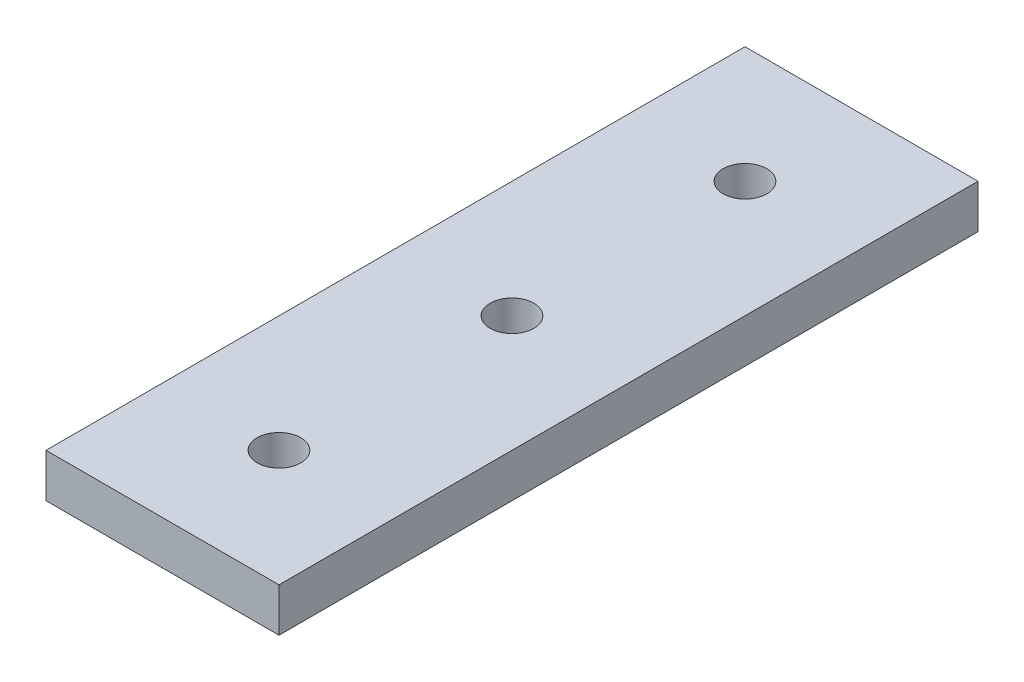
ISO-10303-21;
HEADER;
FILE_DESCRIPTION(('STEP AP214'),'2;1');
FILE_NAME('part.step','',(''),(''),'','','');
FILE_SCHEMA(('AUTOMOTIVE_DESIGN { 1 0 10303 214 1 1 1 1 }'));
ENDSEC;
DATA;
#1=APPLICATION_CONTEXT('core data for automotive mechanical design processes');
#2=APPLICATION_PROTOCOL_DEFINITION('international standard','automotive_design',2000,#1);
#3=PRODUCT_CONTEXT('',#1,'mechanical');
#4=PRODUCT('Part','Part','',(#3));
#5=PRODUCT_RELATED_PRODUCT_CATEGORY('part','',(#4));
#6=PRODUCT_DEFINITION_FORMATION('','',#4);
#7=PRODUCT_DEFINITION_CONTEXT('part definition',#1,'design');
#8=PRODUCT_DEFINITION('design','',#6,#7);
#9=PRODUCT_DEFINITION_SHAPE('','',#8);
#10=(LENGTH_UNIT() NAMED_UNIT(*) SI_UNIT(.MILLI.,.METRE.));
#11=(NAMED_UNIT(*) PLANE_ANGLE_UNIT() SI_UNIT($,.RADIAN.));
#12=(NAMED_UNIT(*) SI_UNIT($,.STERADIAN.) SOLID_ANGLE_UNIT());
#13=UNCERTAINTY_MEASURE_WITH_UNIT(LENGTH_MEASURE(1.E-05),#10,'distance_accuracy_value','');
#14=(GEOMETRIC_REPRESENTATION_CONTEXT(3) GLOBAL_UNCERTAINTY_ASSIGNED_CONTEXT((#13)) GLOBAL_UNIT_ASSIGNED_CONTEXT((#10,
#11,#12)) REPRESENTATION_CONTEXT('',''));
#15=CARTESIAN_POINT('',(0.,0.,0.));
#16=DIRECTION('',(0.,0.,1.));
#17=DIRECTION('',(1.,0.,0.));
#18=AXIS2_PLACEMENT_3D('',#15,#16,#17);
#19=CARTESIAN_POINT('',(12.7,4.7625,-38.1));
#20=DIRECTION('',(-1.,0.,0.));
#21=DIRECTION('',(0.,0.,1.));
#22=AXIS2_PLACEMENT_3D('',#19,#20,#21);
#23=PLANE('',#22);
#24=DIRECTION('',(0.,0.,-1.));
#25=VECTOR('',#24,1.);
#26=CARTESIAN_POINT('',(12.7,0.,-38.1));
#27=LINE('',#26,#25);
#28=CARTESIAN_POINT('',(12.7,0.,38.1));
#29=VERTEX_POINT('',#28);
#30=CARTESIAN_POINT('',(12.7,0.,-38.1));
#31=VERTEX_POINT('',#30);
#32=EDGE_CURVE('E97',#29,#31,#27,.T.);
#33=ORIENTED_EDGE('',*,*,#32,.T.);
#34=DIRECTION('',(0.,-1.,0.));
#35=VECTOR('',#34,1.);
#36=CARTESIAN_POINT('',(12.7,4.7625,-38.1));
#37=LINE('',#36,#35);
#38=CARTESIAN_POINT('',(12.7,4.7625,-38.1));
#39=VERTEX_POINT('',#38);
#40=EDGE_CURVE('E11',#39,#31,#37,.T.);
#41=ORIENTED_EDGE('',*,*,#40,.F.);
#42=DIRECTION('',(0.,0.,-1.));
#43=VECTOR('',#42,1.);
#44=CARTESIAN_POINT('',(12.7,4.7625,-38.1));
#45=LINE('',#44,#43);
#46=CARTESIAN_POINT('',(12.7,4.7625,38.1));
#47=VERTEX_POINT('',#46);
#48=EDGE_CURVE('E85',#47,#39,#45,.T.);
#49=ORIENTED_EDGE('',*,*,#48,.F.);
#50=DIRECTION('',(0.,-1.,0.));
#51=VECTOR('',#50,1.);
#52=CARTESIAN_POINT('',(12.7,4.7625,38.1));
#53=LINE('',#52,#51);
#54=EDGE_CURVE('E93',#47,#29,#53,.T.);
#55=ORIENTED_EDGE('',*,*,#54,.T.);
#56=EDGE_LOOP('',(#33,#41,#49,#55));
#57=FACE_BOUND('',#56,.T.);
#58=ADVANCED_FACE('F34',(#57),#23,.F.);
#59=CARTESIAN_POINT('',(-12.7,4.7625,-38.1));
#60=DIRECTION('',(0.,0.,1.));
#61=DIRECTION('',(1.,0.,0.));
#62=AXIS2_PLACEMENT_3D('',#59,#60,#61);
#63=PLANE('',#62);
#64=DIRECTION('',(-1.,0.,0.));
#65=VECTOR('',#64,1.);
#66=CARTESIAN_POINT('',(-12.7,0.,-38.1));
#67=LINE('',#66,#65);
#68=CARTESIAN_POINT('',(-12.7,0.,-38.1));
#69=VERTEX_POINT('',#68);
#70=EDGE_CURVE('E89',#31,#69,#67,.T.);
#71=ORIENTED_EDGE('',*,*,#70,.T.);
#72=DIRECTION('',(0.,-1.,0.));
#73=VECTOR('',#72,1.);
#74=CARTESIAN_POINT('',(-12.7,4.7625,-38.1));
#75=LINE('',#74,#73);
#76=CARTESIAN_POINT('',(-12.7,4.7625,-38.1));
#77=VERTEX_POINT('',#76);
#78=EDGE_CURVE('E42',#77,#69,#75,.T.);
#79=ORIENTED_EDGE('',*,*,#78,.F.);
#80=DIRECTION('',(-1.,0.,0.));
#81=VECTOR('',#80,1.);
#82=CARTESIAN_POINT('',(-12.7,4.7625,-38.1));
#83=LINE('',#82,#81);
#84=EDGE_CURVE('E80',#39,#77,#83,.T.);
#85=ORIENTED_EDGE('',*,*,#84,.F.);
#86=ORIENTED_EDGE('',*,*,#40,.T.);
#87=EDGE_LOOP('',(#71,#79,#85,#86));
#88=FACE_BOUND('',#87,.T.);
#89=ADVANCED_FACE('F88',(#88),#63,.F.);
#90=CARTESIAN_POINT('',(-12.7,4.7625,-38.1));
#91=DIRECTION('',(1.,0.,0.));
#92=DIRECTION('',(0.,0.,-1.));
#93=AXIS2_PLACEMENT_3D('',#90,#91,#92);
#94=PLANE('',#93);
#95=DIRECTION('',(0.,0.,1.));
#96=VECTOR('',#95,1.);
#97=CARTESIAN_POINT('',(-12.7,0.,-38.1));
#98=LINE('',#97,#96);
#99=CARTESIAN_POINT('',(-12.7,0.,38.1));
#100=VERTEX_POINT('',#99);
#101=EDGE_CURVE('E67',#69,#100,#98,.T.);
#102=ORIENTED_EDGE('',*,*,#101,.T.);
#103=DIRECTION('',(0.,-1.,0.));
#104=VECTOR('',#103,1.);
#105=CARTESIAN_POINT('',(-12.7,4.7625,38.1));
#106=LINE('',#105,#104);
#107=CARTESIAN_POINT('',(-12.7,4.7625,38.1));
#108=VERTEX_POINT('',#107);
#109=EDGE_CURVE('E90',#108,#100,#106,.T.);
#110=ORIENTED_EDGE('',*,*,#109,.F.);
#111=DIRECTION('',(0.,0.,1.));
#112=VECTOR('',#111,1.);
#113=CARTESIAN_POINT('',(-12.7,4.7625,-38.1));
#114=LINE('',#113,#112);
#115=EDGE_CURVE('E83',#77,#108,#114,.T.);
#116=ORIENTED_EDGE('',*,*,#115,.F.);
#117=ORIENTED_EDGE('',*,*,#78,.T.);
#118=EDGE_LOOP('',(#102,#110,#116,#117));
#119=FACE_BOUND('',#118,.T.);
#120=ADVANCED_FACE('F91',(#119),#94,.F.);
#121=CARTESIAN_POINT('',(-12.7,4.7625,38.1));
#122=DIRECTION('',(0.,0.,-1.));
#123=DIRECTION('',(-1.,0.,0.));
#124=AXIS2_PLACEMENT_3D('',#121,#122,#123);
#125=PLANE('',#124);
#126=DIRECTION('',(1.,0.,0.));
#127=VECTOR('',#126,1.);
#128=CARTESIAN_POINT('',(-12.7,0.,38.1));
#129=LINE('',#128,#127);
#130=EDGE_CURVE('E73',#100,#29,#129,.T.);
#131=ORIENTED_EDGE('',*,*,#130,.T.);
#132=ORIENTED_EDGE('',*,*,#54,.F.);
#133=DIRECTION('',(1.,0.,0.));
#134=VECTOR('',#133,1.);
#135=CARTESIAN_POINT('',(-12.7,4.7625,38.1));
#136=LINE('',#135,#134);
#137=EDGE_CURVE('E50',#108,#47,#136,.T.);
#138=ORIENTED_EDGE('',*,*,#137,.F.);
#139=ORIENTED_EDGE('',*,*,#109,.T.);
#140=EDGE_LOOP('',(#131,#132,#138,#139));
#141=FACE_BOUND('',#140,.T.);
#142=ADVANCED_FACE('F105',(#141),#125,.F.);
#143=CARTESIAN_POINT('',(0.,4.7625,0.));
#144=DIRECTION('',(0.,1.,0.));
#145=DIRECTION('',(0.,0.,1.));
#146=AXIS2_PLACEMENT_3D('',#143,#144,#145);
#147=PLANE('',#146);
#148=CARTESIAN_POINT('',(0.,4.7625,-25.4));
#149=DIRECTION('',(0.,1.,0.));
#150=DIRECTION('',(0.,0.,1.));
#151=AXIS2_PLACEMENT_3D('',#148,#149,#150);
#152=CIRCLE('',#151,2.38125);
#153=CARTESIAN_POINT('',(0.,4.7625,-23.01875));
#154=VERTEX_POINT('',#153);
#155=EDGE_CURVE('E123',#154,#154,#152,.T.);
#156=ORIENTED_EDGE('',*,*,#155,.F.);
#157=EDGE_LOOP('',(#156));
#158=FACE_BOUND('',#157,.T.);
#159=CARTESIAN_POINT('',(0.,4.7625,0.));
#160=DIRECTION('',(0.,1.,0.));
#161=DIRECTION('',(0.,0.,1.));
#162=AXIS2_PLACEMENT_3D('',#159,#160,#161);
#163=CIRCLE('',#162,2.38125);
#164=CARTESIAN_POINT('',(0.,4.7625,2.38125));
#165=VERTEX_POINT('',#164);
#166=EDGE_CURVE('E117',#165,#165,#163,.T.);
#167=ORIENTED_EDGE('',*,*,#166,.F.);
#168=EDGE_LOOP('',(#167));
#169=FACE_BOUND('',#168,.T.);
#170=CARTESIAN_POINT('',(0.,4.7625,25.4));
#171=DIRECTION('',(0.,1.,0.));
#172=DIRECTION('',(0.,0.,1.));
#173=AXIS2_PLACEMENT_3D('',#170,#171,#172);
#174=CIRCLE('',#173,2.38125);
#175=CARTESIAN_POINT('',(0.,4.7625,27.78125));
#176=VERTEX_POINT('',#175);
#177=EDGE_CURVE('E111',#176,#176,#174,.T.);
#178=ORIENTED_EDGE('',*,*,#177,.F.);
#179=EDGE_LOOP('',(#178));
#180=FACE_BOUND('',#179,.T.);
#181=ORIENTED_EDGE('',*,*,#48,.T.);
#182=ORIENTED_EDGE('',*,*,#84,.T.);
#183=ORIENTED_EDGE('',*,*,#115,.T.);
#184=ORIENTED_EDGE('',*,*,#137,.T.);
#185=EDGE_LOOP('',(#181,#182,#183,#184));
#186=FACE_BOUND('',#185,.T.);
#187=ADVANCED_FACE('F81',(#158,#169,#180,#186),#147,.T.);
#188=CARTESIAN_POINT('',(0.,0.,0.));
#189=DIRECTION('',(0.,1.,0.));
#190=DIRECTION('',(0.,0.,1.));
#191=AXIS2_PLACEMENT_3D('',#188,#189,#190);
#192=PLANE('',#191);
#193=CARTESIAN_POINT('',(0.,0.,-25.4));
#194=DIRECTION('',(0.,1.,0.));
#195=DIRECTION('',(0.,0.,1.));
#196=AXIS2_PLACEMENT_3D('',#193,#194,#195);
#197=CIRCLE('',#196,2.38125);
#198=CARTESIAN_POINT('',(0.,0.,-23.01875));
#199=VERTEX_POINT('',#198);
#200=EDGE_CURVE('E100',#199,#199,#197,.T.);
#201=ORIENTED_EDGE('',*,*,#200,.T.);
#202=EDGE_LOOP('',(#201));
#203=FACE_BOUND('',#202,.T.);
#204=CARTESIAN_POINT('',(0.,0.,0.));
#205=DIRECTION('',(0.,1.,0.));
#206=DIRECTION('',(0.,0.,1.));
#207=AXIS2_PLACEMENT_3D('',#204,#205,#206);
#208=CIRCLE('',#207,2.38125);
#209=CARTESIAN_POINT('',(0.,0.,2.38125));
#210=VERTEX_POINT('',#209);
#211=EDGE_CURVE('E120',#210,#210,#208,.T.);
#212=ORIENTED_EDGE('',*,*,#211,.T.);
#213=EDGE_LOOP('',(#212));
#214=FACE_BOUND('',#213,.T.);
#215=CARTESIAN_POINT('',(0.,0.,25.4));
#216=DIRECTION('',(0.,1.,0.));
#217=DIRECTION('',(0.,0.,1.));
#218=AXIS2_PLACEMENT_3D('',#215,#216,#217);
#219=CIRCLE('',#218,2.38125);
#220=CARTESIAN_POINT('',(0.,0.,27.78125));
#221=VERTEX_POINT('',#220);
#222=EDGE_CURVE('E114',#221,#221,#219,.T.);
#223=ORIENTED_EDGE('',*,*,#222,.T.);
#224=EDGE_LOOP('',(#223));
#225=FACE_BOUND('',#224,.T.);
#226=ORIENTED_EDGE('',*,*,#32,.F.);
#227=ORIENTED_EDGE('',*,*,#130,.F.);
#228=ORIENTED_EDGE('',*,*,#101,.F.);
#229=ORIENTED_EDGE('',*,*,#70,.F.);
#230=EDGE_LOOP('',(#226,#227,#228,#229));
#231=FACE_BOUND('',#230,.T.);
#232=ADVANCED_FACE('F108',(#203,#214,#225,#231),#192,.F.);
#233=CARTESIAN_POINT('',(0.,0.,25.4));
#234=DIRECTION('',(0.,1.,0.));
#235=DIRECTION('',(0.,0.,1.));
#236=AXIS2_PLACEMENT_3D('',#233,#234,#235);
#237=CYLINDRICAL_SURFACE('',#236,2.38125);
#238=ORIENTED_EDGE('',*,*,#222,.F.);
#239=EDGE_LOOP('',(#238));
#240=FACE_BOUND('',#239,.T.);
#241=ORIENTED_EDGE('',*,*,#177,.T.);
#242=EDGE_LOOP('',(#241));
#243=FACE_BOUND('',#242,.T.);
#244=ADVANCED_FACE('F145',(#240,#243),#237,.F.);
#245=CARTESIAN_POINT('',(0.,0.,0.));
#246=DIRECTION('',(0.,1.,0.));
#247=DIRECTION('',(0.,0.,1.));
#248=AXIS2_PLACEMENT_3D('',#245,#246,#247);
#249=CYLINDRICAL_SURFACE('',#248,2.38125);
#250=ORIENTED_EDGE('',*,*,#211,.F.);
#251=EDGE_LOOP('',(#250));
#252=FACE_BOUND('',#251,.T.);
#253=ORIENTED_EDGE('',*,*,#166,.T.);
#254=EDGE_LOOP('',(#253));
#255=FACE_BOUND('',#254,.T.);
#256=ADVANCED_FACE('F134',(#252,#255),#249,.F.);
#257=CARTESIAN_POINT('',(0.,0.,-25.4));
#258=DIRECTION('',(0.,1.,0.));
#259=DIRECTION('',(0.,0.,1.));
#260=AXIS2_PLACEMENT_3D('',#257,#258,#259);
#261=CYLINDRICAL_SURFACE('',#260,2.38125);
#262=ORIENTED_EDGE('',*,*,#200,.F.);
#263=EDGE_LOOP('',(#262));
#264=FACE_BOUND('',#263,.T.);
#265=ORIENTED_EDGE('',*,*,#155,.T.);
#266=EDGE_LOOP('',(#265));
#267=FACE_BOUND('',#266,.T.);
#268=ADVANCED_FACE('F131',(#264,#267),#261,.F.);
#269=CLOSED_SHELL('',(#58,#89,#120,#142,#187,#232,#244,#256,#268));
#270=MANIFOLD_SOLID_BREP('B2',#269);
#271=ADVANCED_BREP_SHAPE_REPRESENTATION('',(#18,#270),#14);
#272=SHAPE_DEFINITION_REPRESENTATION(#9,#271);
ENDSEC;
END-ISO-10303-21;
